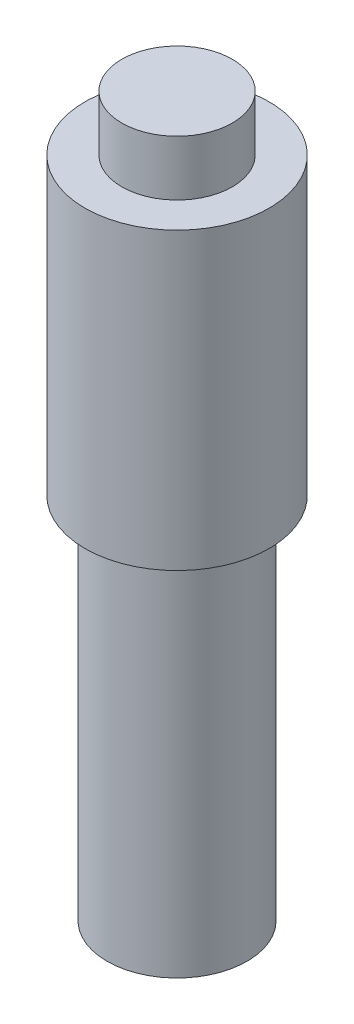
ISO-10303-21;
HEADER;
FILE_DESCRIPTION(('STEP AP214'),'2;1');
FILE_NAME('part.step','',(''),(''),'','','');
FILE_SCHEMA(('AUTOMOTIVE_DESIGN { 1 0 10303 214 1 1 1 1 }'));
ENDSEC;
DATA;
#1=APPLICATION_CONTEXT('core data for automotive mechanical design processes');
#2=APPLICATION_PROTOCOL_DEFINITION('international standard','automotive_design',2000,#1);
#3=PRODUCT_CONTEXT('',#1,'mechanical');
#4=PRODUCT('Part','Part','',(#3));
#5=PRODUCT_RELATED_PRODUCT_CATEGORY('part','',(#4));
#6=PRODUCT_DEFINITION_FORMATION('','',#4);
#7=PRODUCT_DEFINITION_CONTEXT('part definition',#1,'design');
#8=PRODUCT_DEFINITION('design','',#6,#7);
#9=PRODUCT_DEFINITION_SHAPE('','',#8);
#10=(LENGTH_UNIT() NAMED_UNIT(*) SI_UNIT(.MILLI.,.METRE.));
#11=(NAMED_UNIT(*) PLANE_ANGLE_UNIT() SI_UNIT($,.RADIAN.));
#12=(NAMED_UNIT(*) SI_UNIT($,.STERADIAN.) SOLID_ANGLE_UNIT());
#13=UNCERTAINTY_MEASURE_WITH_UNIT(LENGTH_MEASURE(1.E-05),#10,'distance_accuracy_value','');
#14=(GEOMETRIC_REPRESENTATION_CONTEXT(3) GLOBAL_UNCERTAINTY_ASSIGNED_CONTEXT((#13)) GLOBAL_UNIT_ASSIGNED_CONTEXT((#10,
#11,#12)) REPRESENTATION_CONTEXT('',''));
#15=CARTESIAN_POINT('',(0.,0.,0.));
#16=DIRECTION('',(0.,0.,1.));
#17=DIRECTION('',(1.,0.,0.));
#18=AXIS2_PLACEMENT_3D('',#15,#16,#17);
#19=CARTESIAN_POINT('',(0.,-39.,0.));
#20=DIRECTION('',(0.,1.,0.));
#21=DIRECTION('',(0.,0.,1.));
#22=AXIS2_PLACEMENT_3D('',#19,#20,#21);
#23=PLANE('',#22);
#24=CARTESIAN_POINT('',(0.,-39.,0.));
#25=DIRECTION('',(0.,1.,0.));
#26=DIRECTION('',(0.,0.,1.));
#27=AXIS2_PLACEMENT_3D('',#24,#25,#26);
#28=CIRCLE('',#27,3.80000000000001);
#29=CARTESIAN_POINT('',(0.,-39.,3.80000000000001));
#30=VERTEX_POINT('',#29);
#31=EDGE_CURVE('E10',#30,#30,#28,.T.);
#32=ORIENTED_EDGE('',*,*,#31,.F.);
#33=EDGE_LOOP('',(#32));
#34=FACE_BOUND('',#33,.T.);
#35=ADVANCED_FACE('F30',(#34),#23,.F.);
#36=CARTESIAN_POINT('',(0.,46.1554318605903,0.));
#37=DIRECTION('',(0.,1.,0.));
#38=DIRECTION('',(0.,0.,1.));
#39=AXIS2_PLACEMENT_3D('',#36,#37,#38);
#40=CYLINDRICAL_SURFACE('',#39,3.80000000000001);
#41=CARTESIAN_POINT('',(0.,-19.,0.));
#42=DIRECTION('',(0.,1.,0.));
#43=DIRECTION('',(0.,0.,1.));
#44=AXIS2_PLACEMENT_3D('',#41,#42,#43);
#45=CIRCLE('',#44,3.80000000000001);
#46=CARTESIAN_POINT('',(0.,-19.,3.80000000000001));
#47=VERTEX_POINT('',#46);
#48=EDGE_CURVE('E36',#47,#47,#45,.T.);
#49=ORIENTED_EDGE('',*,*,#48,.F.);
#50=EDGE_LOOP('',(#49));
#51=FACE_BOUND('',#50,.T.);
#52=ORIENTED_EDGE('',*,*,#31,.T.);
#53=EDGE_LOOP('',(#52));
#54=FACE_BOUND('',#53,.T.);
#55=ADVANCED_FACE('F78',(#51,#54),#40,.T.);
#56=CARTESIAN_POINT('',(3.80000000000001,-19.,0.));
#57=DIRECTION('',(0.,1.,0.));
#58=DIRECTION('',(0.,0.,1.));
#59=AXIS2_PLACEMENT_3D('',#56,#57,#58);
#60=PLANE('',#59);
#61=CARTESIAN_POINT('',(0.,-19.,0.));
#62=DIRECTION('',(0.,1.,0.));
#63=DIRECTION('',(0.,0.,1.));
#64=AXIS2_PLACEMENT_3D('',#61,#62,#63);
#65=CIRCLE('',#64,5.00000000000001);
#66=CARTESIAN_POINT('',(0.,-19.,5.00000000000001));
#67=VERTEX_POINT('',#66);
#68=EDGE_CURVE('E40',#67,#67,#65,.T.);
#69=ORIENTED_EDGE('',*,*,#68,.F.);
#70=EDGE_LOOP('',(#69));
#71=FACE_BOUND('',#70,.T.);
#72=ORIENTED_EDGE('',*,*,#48,.T.);
#73=EDGE_LOOP('',(#72));
#74=FACE_BOUND('',#73,.T.);
#75=ADVANCED_FACE('F73',(#71,#74),#60,.F.);
#76=CARTESIAN_POINT('',(0.,46.1554318605903,0.));
#77=DIRECTION('',(0.,1.,0.));
#78=DIRECTION('',(0.,0.,1.));
#79=AXIS2_PLACEMENT_3D('',#76,#77,#78);
#80=CYLINDRICAL_SURFACE('',#79,5.00000000000001);
#81=CARTESIAN_POINT('',(0.,-3.,0.));
#82=DIRECTION('',(0.,1.,0.));
#83=DIRECTION('',(0.,0.,1.));
#84=AXIS2_PLACEMENT_3D('',#81,#82,#83);
#85=CIRCLE('',#84,5.00000000000001);
#86=CARTESIAN_POINT('',(0.,-3.,5.00000000000001));
#87=VERTEX_POINT('',#86);
#88=EDGE_CURVE('E44',#87,#87,#85,.T.);
#89=ORIENTED_EDGE('',*,*,#88,.F.);
#90=EDGE_LOOP('',(#89));
#91=FACE_BOUND('',#90,.T.);
#92=ORIENTED_EDGE('',*,*,#68,.T.);
#93=EDGE_LOOP('',(#92));
#94=FACE_BOUND('',#93,.T.);
#95=ADVANCED_FACE('F67',(#91,#94),#80,.T.);
#96=CARTESIAN_POINT('',(5.00000000000001,-3.,0.));
#97=DIRECTION('',(0.,-1.,0.));
#98=DIRECTION('',(0.,0.,-1.));
#99=AXIS2_PLACEMENT_3D('',#96,#97,#98);
#100=PLANE('',#99);
#101=CARTESIAN_POINT('',(0.,-3.,0.));
#102=DIRECTION('',(0.,1.,0.));
#103=DIRECTION('',(0.,0.,1.));
#104=AXIS2_PLACEMENT_3D('',#101,#102,#103);
#105=CIRCLE('',#104,3.00000000000001);
#106=CARTESIAN_POINT('',(0.,-3.,3.00000000000001));
#107=VERTEX_POINT('',#106);
#108=EDGE_CURVE('E49',#107,#107,#105,.T.);
#109=ORIENTED_EDGE('',*,*,#108,.F.);
#110=EDGE_LOOP('',(#109));
#111=FACE_BOUND('',#110,.T.);
#112=ORIENTED_EDGE('',*,*,#88,.T.);
#113=EDGE_LOOP('',(#112));
#114=FACE_BOUND('',#113,.T.);
#115=ADVANCED_FACE('F61',(#111,#114),#100,.F.);
#116=CARTESIAN_POINT('',(0.,46.1554318605903,0.));
#117=DIRECTION('',(0.,1.,0.));
#118=DIRECTION('',(0.,0.,1.));
#119=AXIS2_PLACEMENT_3D('',#116,#117,#118);
#120=CYLINDRICAL_SURFACE('',#119,3.00000000000001);
#121=CARTESIAN_POINT('',(0.,0.,0.));
#122=DIRECTION('',(0.,1.,0.));
#123=DIRECTION('',(0.,0.,1.));
#124=AXIS2_PLACEMENT_3D('',#121,#122,#123);
#125=CIRCLE('',#124,3.00000000000001);
#126=CARTESIAN_POINT('',(0.,0.,3.00000000000001));
#127=VERTEX_POINT('',#126);
#128=EDGE_CURVE('E52',#127,#127,#125,.T.);
#129=ORIENTED_EDGE('',*,*,#128,.F.);
#130=EDGE_LOOP('',(#129));
#131=FACE_BOUND('',#130,.T.);
#132=ORIENTED_EDGE('',*,*,#108,.T.);
#133=EDGE_LOOP('',(#132));
#134=FACE_BOUND('',#133,.T.);
#135=ADVANCED_FACE('F58',(#131,#134),#120,.T.);
#136=CARTESIAN_POINT('',(0.,0.,0.));
#137=DIRECTION('',(0.,-1.,0.));
#138=DIRECTION('',(0.,0.,-1.));
#139=AXIS2_PLACEMENT_3D('',#136,#137,#138);
#140=PLANE('',#139);
#141=ORIENTED_EDGE('',*,*,#128,.T.);
#142=EDGE_LOOP('',(#141));
#143=FACE_BOUND('',#142,.T.);
#144=ADVANCED_FACE('F56',(#143),#140,.F.);
#145=CLOSED_SHELL('',(#35,#55,#75,#95,#115,#135,#144));
#146=MANIFOLD_SOLID_BREP('B2',#145);
#147=ADVANCED_BREP_SHAPE_REPRESENTATION('',(#18,#146),#14);
#148=SHAPE_DEFINITION_REPRESENTATION(#9,#147);
ENDSEC;
END-ISO-10303-21;
